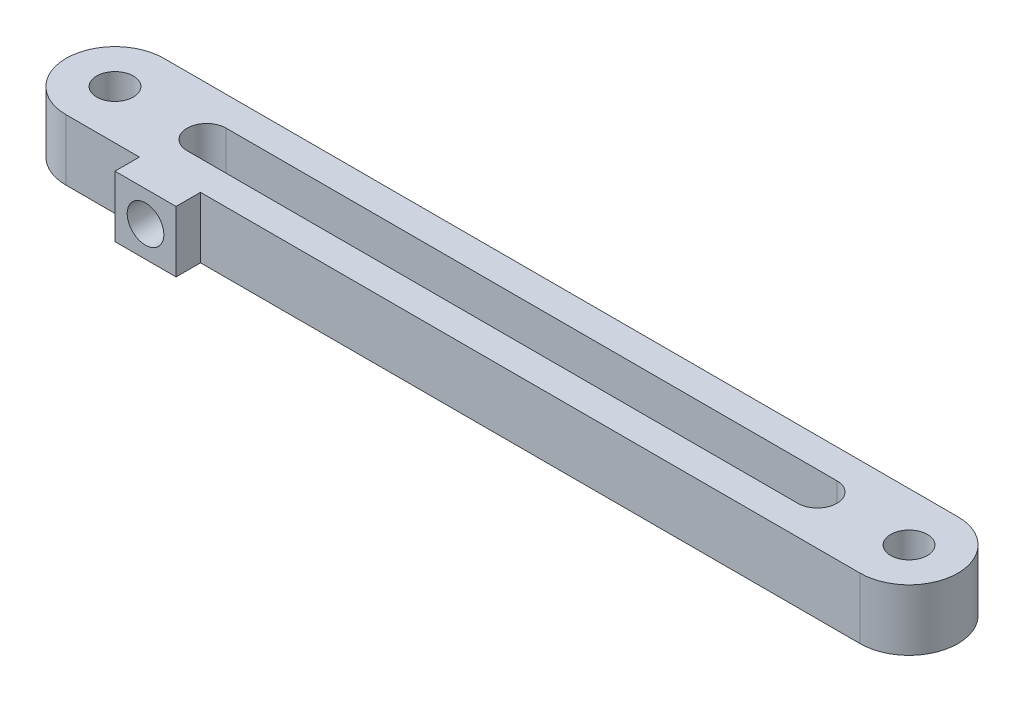
ISO-10303-21;
HEADER;
FILE_DESCRIPTION(('STEP AP214'),'2;1');
FILE_NAME('part.step','',(''),(''),'','','');
FILE_SCHEMA(('AUTOMOTIVE_DESIGN { 1 0 10303 214 1 1 1 1 }'));
ENDSEC;
DATA;
#1=APPLICATION_CONTEXT('core data for automotive mechanical design processes');
#2=APPLICATION_PROTOCOL_DEFINITION('international standard','automotive_design',2000,#1);
#3=PRODUCT_CONTEXT('',#1,'mechanical');
#4=PRODUCT('Part','Part','',(#3));
#5=PRODUCT_RELATED_PRODUCT_CATEGORY('part','',(#4));
#6=PRODUCT_DEFINITION_FORMATION('','',#4);
#7=PRODUCT_DEFINITION_CONTEXT('part definition',#1,'design');
#8=PRODUCT_DEFINITION('design','',#6,#7);
#9=PRODUCT_DEFINITION_SHAPE('','',#8);
#10=(LENGTH_UNIT() NAMED_UNIT(*) SI_UNIT(.MILLI.,.METRE.));
#11=(NAMED_UNIT(*) PLANE_ANGLE_UNIT() SI_UNIT($,.RADIAN.));
#12=(NAMED_UNIT(*) SI_UNIT($,.STERADIAN.) SOLID_ANGLE_UNIT());
#13=UNCERTAINTY_MEASURE_WITH_UNIT(LENGTH_MEASURE(1.E-05),#10,'distance_accuracy_value','');
#14=(GEOMETRIC_REPRESENTATION_CONTEXT(3) GLOBAL_UNCERTAINTY_ASSIGNED_CONTEXT((#13)) GLOBAL_UNIT_ASSIGNED_CONTEXT((#10,
#11,#12)) REPRESENTATION_CONTEXT('',''));
#15=CARTESIAN_POINT('',(0.,0.,0.));
#16=DIRECTION('',(0.,0.,1.));
#17=DIRECTION('',(1.,0.,0.));
#18=AXIS2_PLACEMENT_3D('',#15,#16,#17);
#19=CARTESIAN_POINT('',(-32.5,5.,4.));
#20=DIRECTION('',(0.,0.,-1.));
#21=DIRECTION('',(-1.,0.,0.));
#22=AXIS2_PLACEMENT_3D('',#19,#20,#21);
#23=PLANE('',#22);
#24=DIRECTION('',(0.,-1.,0.));
#25=VECTOR('',#24,1.);
#26=CARTESIAN_POINT('',(-26.5,5.,3.99999999999999));
#27=LINE('',#26,#25);
#28=CARTESIAN_POINT('',(-26.5,5.,3.99999999999999));
#29=VERTEX_POINT('',#28);
#30=CARTESIAN_POINT('',(-26.5,0.,3.99999999999999));
#31=VERTEX_POINT('',#30);
#32=EDGE_CURVE('E214',#29,#31,#27,.T.);
#33=ORIENTED_EDGE('',*,*,#32,.F.);
#34=DIRECTION('',(1.,0.,0.));
#35=VECTOR('',#34,1.);
#36=CARTESIAN_POINT('',(-32.5,5.,4.));
#37=LINE('',#36,#35);
#38=CARTESIAN_POINT('',(-32.5,5.,4.));
#39=VERTEX_POINT('',#38);
#40=EDGE_CURVE('E286',#39,#29,#37,.T.);
#41=ORIENTED_EDGE('',*,*,#40,.F.);
#42=DIRECTION('',(0.,-1.,0.));
#43=VECTOR('',#42,1.);
#44=CARTESIAN_POINT('',(-32.5,5.,4.));
#45=LINE('',#44,#43);
#46=CARTESIAN_POINT('',(-32.5,0.,4.));
#47=VERTEX_POINT('',#46);
#48=EDGE_CURVE('E12',#39,#47,#45,.T.);
#49=ORIENTED_EDGE('',*,*,#48,.T.);
#50=DIRECTION('',(1.,0.,0.));
#51=VECTOR('',#50,1.);
#52=CARTESIAN_POINT('',(-32.5,0.,4.));
#53=LINE('',#52,#51);
#54=EDGE_CURVE('E302',#47,#31,#53,.T.);
#55=ORIENTED_EDGE('',*,*,#54,.T.);
#56=EDGE_LOOP('',(#33,#41,#49,#55));
#57=FACE_BOUND('',#56,.T.);
#58=ADVANCED_FACE('F97',(#57),#23,.F.);
#59=DIRECTION('',(0.,1.,0.));
#60=VECTOR('',#59,1.);
#61=CARTESIAN_POINT('',(-21.5,5.,3.99999999999999));
#62=LINE('',#61,#60);
#63=CARTESIAN_POINT('',(-21.5,0.,3.99999999999999));
#64=VERTEX_POINT('',#63);
#65=CARTESIAN_POINT('',(-21.5,5.,4.));
#66=VERTEX_POINT('',#65);
#67=EDGE_CURVE('E210',#64,#66,#62,.T.);
#68=ORIENTED_EDGE('',*,*,#67,.F.);
#69=CARTESIAN_POINT('',(32.5,0.,3.99999999999999));
#70=VERTEX_POINT('',#69);
#71=EDGE_CURVE('E301',#64,#70,#53,.T.);
#72=ORIENTED_EDGE('',*,*,#71,.T.);
#73=DIRECTION('',(0.,-1.,0.));
#74=VECTOR('',#73,1.);
#75=CARTESIAN_POINT('',(32.5,5.,3.99999999999999));
#76=LINE('',#75,#74);
#77=CARTESIAN_POINT('',(32.5,5.,3.99999999999999));
#78=VERTEX_POINT('',#77);
#79=EDGE_CURVE('E106',#78,#70,#76,.T.);
#80=ORIENTED_EDGE('',*,*,#79,.F.);
#81=EDGE_CURVE('E284',#66,#78,#37,.T.);
#82=ORIENTED_EDGE('',*,*,#81,.F.);
#83=EDGE_LOOP('',(#68,#72,#80,#82));
#84=FACE_BOUND('',#83,.T.);
#85=ADVANCED_FACE('F337',(#84),#23,.F.);
#86=CARTESIAN_POINT('',(-32.5,5.,0.));
#87=DIRECTION('',(0.,1.,0.));
#88=DIRECTION('',(0.,0.,1.));
#89=AXIS2_PLACEMENT_3D('',#86,#87,#88);
#90=PLANE('',#89);
#91=CARTESIAN_POINT('',(32.5,5.,0.));
#92=DIRECTION('',(0.,1.,0.));
#93=DIRECTION('',(0.,0.,1.));
#94=AXIS2_PLACEMENT_3D('',#91,#92,#93);
#95=CIRCLE('',#94,1.5);
#96=CARTESIAN_POINT('',(32.5,5.,1.49999999999998));
#97=VERTEX_POINT('',#96);
#98=EDGE_CURVE('E272',#97,#97,#95,.T.);
#99=ORIENTED_EDGE('',*,*,#98,.F.);
#100=EDGE_LOOP('',(#99));
#101=FACE_BOUND('',#100,.T.);
#102=CARTESIAN_POINT('',(-32.5,5.,0.));
#103=DIRECTION('',(0.,1.,0.));
#104=DIRECTION('',(0.,0.,1.));
#105=AXIS2_PLACEMENT_3D('',#102,#103,#104);
#106=CIRCLE('',#105,4.);
#107=CARTESIAN_POINT('',(-32.5,5.,-4.));
#108=VERTEX_POINT('',#107);
#109=EDGE_CURVE('E280',#108,#39,#106,.T.);
#110=ORIENTED_EDGE('',*,*,#109,.T.);
#111=ORIENTED_EDGE('',*,*,#40,.T.);
#112=DIRECTION('',(0.,0.,-1.));
#113=VECTOR('',#112,1.);
#114=CARTESIAN_POINT('',(-26.5,5.,5.99999999999999));
#115=LINE('',#114,#113);
#116=CARTESIAN_POINT('',(-26.5,5.,5.99999999999999));
#117=VERTEX_POINT('',#116);
#118=EDGE_CURVE('E346',#117,#29,#115,.T.);
#119=ORIENTED_EDGE('',*,*,#118,.F.);
#120=DIRECTION('',(-1.,0.,0.));
#121=VECTOR('',#120,1.);
#122=CARTESIAN_POINT('',(-26.5,5.,5.99999999999999));
#123=LINE('',#122,#121);
#124=CARTESIAN_POINT('',(-21.5,5.,5.99999999999999));
#125=VERTEX_POINT('',#124);
#126=EDGE_CURVE('E206',#125,#117,#123,.T.);
#127=ORIENTED_EDGE('',*,*,#126,.F.);
#128=DIRECTION('',(0.,0.,-1.));
#129=VECTOR('',#128,1.);
#130=CARTESIAN_POINT('',(-21.5,5.,5.99999999999999));
#131=LINE('',#130,#129);
#132=EDGE_CURVE('E113',#125,#66,#131,.T.);
#133=ORIENTED_EDGE('',*,*,#132,.T.);
#134=ORIENTED_EDGE('',*,*,#81,.T.);
#135=CARTESIAN_POINT('',(32.5,5.,0.));
#136=DIRECTION('',(0.,1.,0.));
#137=DIRECTION('',(0.,0.,1.));
#138=AXIS2_PLACEMENT_3D('',#135,#136,#137);
#139=CIRCLE('',#138,4.);
#140=CARTESIAN_POINT('',(32.5,5.,-4.00000000000001));
#141=VERTEX_POINT('',#140);
#142=EDGE_CURVE('E290',#78,#141,#139,.T.);
#143=ORIENTED_EDGE('',*,*,#142,.T.);
#144=DIRECTION('',(1.,0.,0.));
#145=VECTOR('',#144,1.);
#146=CARTESIAN_POINT('',(-32.5,5.,-4.));
#147=LINE('',#146,#145);
#148=EDGE_CURVE('E293',#108,#141,#147,.T.);
#149=ORIENTED_EDGE('',*,*,#148,.F.);
#150=EDGE_LOOP('',(#110,#111,#119,#127,#133,#134,#143,#149));
#151=FACE_BOUND('',#150,.T.);
#152=CARTESIAN_POINT('',(-32.5,5.,0.));
#153=DIRECTION('',(0.,1.,0.));
#154=DIRECTION('',(0.,0.,1.));
#155=AXIS2_PLACEMENT_3D('',#152,#153,#154);
#156=CIRCLE('',#155,1.5);
#157=CARTESIAN_POINT('',(-32.5,5.,1.5));
#158=VERTEX_POINT('',#157);
#159=EDGE_CURVE('E264',#158,#158,#156,.T.);
#160=ORIENTED_EDGE('',*,*,#159,.F.);
#161=EDGE_LOOP('',(#160));
#162=FACE_BOUND('',#161,.T.);
#163=DIRECTION('',(1.,0.,0.));
#164=VECTOR('',#163,1.);
#165=CARTESIAN_POINT('',(-25.,5.,1.6));
#166=LINE('',#165,#164);
#167=CARTESIAN_POINT('',(-25.,5.,1.6));
#168=VERTEX_POINT('',#167);
#169=CARTESIAN_POINT('',(25.,5.,1.59999999999999));
#170=VERTEX_POINT('',#169);
#171=EDGE_CURVE('E230',#168,#170,#166,.T.);
#172=ORIENTED_EDGE('',*,*,#171,.F.);
#173=CARTESIAN_POINT('',(-25.,5.,0.));
#174=DIRECTION('',(0.,1.,0.));
#175=DIRECTION('',(0.,0.,1.));
#176=AXIS2_PLACEMENT_3D('',#173,#174,#175);
#177=CIRCLE('',#176,1.6);
#178=CARTESIAN_POINT('',(-25.,5.,-1.6));
#179=VERTEX_POINT('',#178);
#180=EDGE_CURVE('E227',#179,#168,#177,.T.);
#181=ORIENTED_EDGE('',*,*,#180,.F.);
#182=DIRECTION('',(1.,0.,0.));
#183=VECTOR('',#182,1.);
#184=CARTESIAN_POINT('',(-25.,5.,-1.6));
#185=LINE('',#184,#183);
#186=CARTESIAN_POINT('',(25.,5.,-1.60000000000001));
#187=VERTEX_POINT('',#186);
#188=EDGE_CURVE('E237',#179,#187,#185,.T.);
#189=ORIENTED_EDGE('',*,*,#188,.T.);
#190=CARTESIAN_POINT('',(25.,5.,0.));
#191=DIRECTION('',(0.,1.,0.));
#192=DIRECTION('',(0.,0.,1.));
#193=AXIS2_PLACEMENT_3D('',#190,#191,#192);
#194=CIRCLE('',#193,1.6);
#195=EDGE_CURVE('E234',#170,#187,#194,.T.);
#196=ORIENTED_EDGE('',*,*,#195,.F.);
#197=EDGE_LOOP('',(#172,#181,#189,#196));
#198=FACE_BOUND('',#197,.T.);
#199=ADVANCED_FACE('F331',(#101,#151,#162,#198),#90,.T.);
#200=CARTESIAN_POINT('',(-32.5,0.,0.));
#201=DIRECTION('',(0.,1.,0.));
#202=DIRECTION('',(0.,0.,1.));
#203=AXIS2_PLACEMENT_3D('',#200,#201,#202);
#204=PLANE('',#203);
#205=CARTESIAN_POINT('',(-32.5,0.,0.));
#206=DIRECTION('',(0.,1.,0.));
#207=DIRECTION('',(0.,0.,1.));
#208=AXIS2_PLACEMENT_3D('',#205,#206,#207);
#209=CIRCLE('',#208,1.5);
#210=CARTESIAN_POINT('',(-32.5,0.,1.5));
#211=VERTEX_POINT('',#210);
#212=EDGE_CURVE('E263',#211,#211,#209,.T.);
#213=ORIENTED_EDGE('',*,*,#212,.T.);
#214=EDGE_LOOP('',(#213));
#215=FACE_BOUND('',#214,.T.);
#216=CARTESIAN_POINT('',(32.5,0.,0.));
#217=DIRECTION('',(0.,1.,0.));
#218=DIRECTION('',(0.,0.,1.));
#219=AXIS2_PLACEMENT_3D('',#216,#217,#218);
#220=CIRCLE('',#219,1.5);
#221=CARTESIAN_POINT('',(32.5,0.,1.49999999999998));
#222=VERTEX_POINT('',#221);
#223=EDGE_CURVE('E268',#222,#222,#220,.T.);
#224=ORIENTED_EDGE('',*,*,#223,.T.);
#225=EDGE_LOOP('',(#224));
#226=FACE_BOUND('',#225,.T.);
#227=CARTESIAN_POINT('',(-32.5,0.,0.));
#228=DIRECTION('',(0.,1.,0.));
#229=DIRECTION('',(0.,0.,1.));
#230=AXIS2_PLACEMENT_3D('',#227,#228,#229);
#231=CIRCLE('',#230,4.);
#232=CARTESIAN_POINT('',(-32.5,0.,-4.));
#233=VERTEX_POINT('',#232);
#234=EDGE_CURVE('E276',#233,#47,#231,.T.);
#235=ORIENTED_EDGE('',*,*,#234,.F.);
#236=DIRECTION('',(1.,0.,0.));
#237=VECTOR('',#236,1.);
#238=CARTESIAN_POINT('',(-32.5,0.,-4.));
#239=LINE('',#238,#237);
#240=CARTESIAN_POINT('',(32.5,0.,-4.00000000000001));
#241=VERTEX_POINT('',#240);
#242=EDGE_CURVE('E285',#233,#241,#239,.T.);
#243=ORIENTED_EDGE('',*,*,#242,.T.);
#244=CARTESIAN_POINT('',(32.5,0.,0.));
#245=DIRECTION('',(0.,1.,0.));
#246=DIRECTION('',(0.,0.,1.));
#247=AXIS2_PLACEMENT_3D('',#244,#245,#246);
#248=CIRCLE('',#247,4.);
#249=EDGE_CURVE('E305',#70,#241,#248,.T.);
#250=ORIENTED_EDGE('',*,*,#249,.F.);
#251=ORIENTED_EDGE('',*,*,#71,.F.);
#252=DIRECTION('',(0.,0.,-1.));
#253=VECTOR('',#252,1.);
#254=CARTESIAN_POINT('',(-21.5,0.,5.99999999999999));
#255=LINE('',#254,#253);
#256=CARTESIAN_POINT('',(-21.5,0.,5.99999999999999));
#257=VERTEX_POINT('',#256);
#258=EDGE_CURVE('E197',#257,#64,#255,.T.);
#259=ORIENTED_EDGE('',*,*,#258,.F.);
#260=DIRECTION('',(1.,0.,0.));
#261=VECTOR('',#260,1.);
#262=CARTESIAN_POINT('',(-26.5,0.,5.99999999999999));
#263=LINE('',#262,#261);
#264=CARTESIAN_POINT('',(-26.5,0.,5.99999999999999));
#265=VERTEX_POINT('',#264);
#266=EDGE_CURVE('E188',#265,#257,#263,.T.);
#267=ORIENTED_EDGE('',*,*,#266,.F.);
#268=DIRECTION('',(0.,0.,-1.));
#269=VECTOR('',#268,1.);
#270=CARTESIAN_POINT('',(-26.5,0.,5.99999999999999));
#271=LINE('',#270,#269);
#272=EDGE_CURVE('E194',#265,#31,#271,.T.);
#273=ORIENTED_EDGE('',*,*,#272,.T.);
#274=ORIENTED_EDGE('',*,*,#54,.F.);
#275=EDGE_LOOP('',(#235,#243,#250,#251,#259,#267,#273,#274));
#276=FACE_BOUND('',#275,.T.);
#277=CARTESIAN_POINT('',(-25.,0.,0.));
#278=DIRECTION('',(0.,1.,0.));
#279=DIRECTION('',(0.,0.,1.));
#280=AXIS2_PLACEMENT_3D('',#277,#278,#279);
#281=CIRCLE('',#280,1.6);
#282=CARTESIAN_POINT('',(-25.,0.,-1.6));
#283=VERTEX_POINT('',#282);
#284=CARTESIAN_POINT('',(-25.,0.,1.6));
#285=VERTEX_POINT('',#284);
#286=EDGE_CURVE('E217',#283,#285,#281,.T.);
#287=ORIENTED_EDGE('',*,*,#286,.T.);
#288=DIRECTION('',(1.,0.,0.));
#289=VECTOR('',#288,1.);
#290=CARTESIAN_POINT('',(-25.,0.,1.6));
#291=LINE('',#290,#289);
#292=CARTESIAN_POINT('',(25.,0.,1.59999999999999));
#293=VERTEX_POINT('',#292);
#294=EDGE_CURVE('E222',#285,#293,#291,.T.);
#295=ORIENTED_EDGE('',*,*,#294,.T.);
#296=CARTESIAN_POINT('',(25.,0.,0.));
#297=DIRECTION('',(0.,1.,0.));
#298=DIRECTION('',(0.,0.,1.));
#299=AXIS2_PLACEMENT_3D('',#296,#297,#298);
#300=CIRCLE('',#299,1.6);
#301=CARTESIAN_POINT('',(25.,0.,-1.60000000000001));
#302=VERTEX_POINT('',#301);
#303=EDGE_CURVE('E245',#293,#302,#300,.T.);
#304=ORIENTED_EDGE('',*,*,#303,.T.);
#305=DIRECTION('',(1.,0.,0.));
#306=VECTOR('',#305,1.);
#307=CARTESIAN_POINT('',(-25.,0.,-1.6));
#308=LINE('',#307,#306);
#309=EDGE_CURVE('E231',#283,#302,#308,.T.);
#310=ORIENTED_EDGE('',*,*,#309,.F.);
#311=EDGE_LOOP('',(#287,#295,#304,#310));
#312=FACE_BOUND('',#311,.T.);
#313=ADVANCED_FACE('F191',(#215,#226,#276,#312),#204,.F.);
#314=CARTESIAN_POINT('',(-32.5,5.,0.));
#315=DIRECTION('',(0.,-1.,0.));
#316=DIRECTION('',(0.,0.,-1.));
#317=AXIS2_PLACEMENT_3D('',#314,#315,#316);
#318=CYLINDRICAL_SURFACE('',#317,4.);
#319=ORIENTED_EDGE('',*,*,#234,.T.);
#320=ORIENTED_EDGE('',*,*,#48,.F.);
#321=ORIENTED_EDGE('',*,*,#109,.F.);
#322=DIRECTION('',(0.,-1.,0.));
#323=VECTOR('',#322,1.);
#324=CARTESIAN_POINT('',(-32.5,5.,-4.));
#325=LINE('',#324,#323);
#326=EDGE_CURVE('E297',#108,#233,#325,.T.);
#327=ORIENTED_EDGE('',*,*,#326,.T.);
#328=EDGE_LOOP('',(#319,#320,#321,#327));
#329=FACE_BOUND('',#328,.T.);
#330=ADVANCED_FACE('F99',(#329),#318,.T.);
#331=CARTESIAN_POINT('',(32.5,5.,0.));
#332=DIRECTION('',(0.,-1.,0.));
#333=DIRECTION('',(0.,0.,-1.));
#334=AXIS2_PLACEMENT_3D('',#331,#332,#333);
#335=CYLINDRICAL_SURFACE('',#334,4.);
#336=ORIENTED_EDGE('',*,*,#249,.T.);
#337=DIRECTION('',(0.,-1.,0.));
#338=VECTOR('',#337,1.);
#339=CARTESIAN_POINT('',(32.5,5.,-4.00000000000001));
#340=LINE('',#339,#338);
#341=EDGE_CURVE('E314',#141,#241,#340,.T.);
#342=ORIENTED_EDGE('',*,*,#341,.F.);
#343=ORIENTED_EDGE('',*,*,#142,.F.);
#344=ORIENTED_EDGE('',*,*,#79,.T.);
#345=EDGE_LOOP('',(#336,#342,#343,#344));
#346=FACE_BOUND('',#345,.T.);
#347=ADVANCED_FACE('F322',(#346),#335,.T.);
#348=CARTESIAN_POINT('',(-32.5,5.,-4.));
#349=DIRECTION('',(0.,0.,-1.));
#350=DIRECTION('',(-1.,0.,0.));
#351=AXIS2_PLACEMENT_3D('',#348,#349,#350);
#352=PLANE('',#351);
#353=ORIENTED_EDGE('',*,*,#242,.F.);
#354=ORIENTED_EDGE('',*,*,#326,.F.);
#355=ORIENTED_EDGE('',*,*,#148,.T.);
#356=ORIENTED_EDGE('',*,*,#341,.T.);
#357=EDGE_LOOP('',(#353,#354,#355,#356));
#358=FACE_BOUND('',#357,.T.);
#359=ADVANCED_FACE('F328',(#358),#352,.T.);
#360=CARTESIAN_POINT('',(32.5,5.,0.));
#361=DIRECTION('',(0.,-1.,0.));
#362=DIRECTION('',(0.,0.,-1.));
#363=AXIS2_PLACEMENT_3D('',#360,#361,#362);
#364=CYLINDRICAL_SURFACE('',#363,1.5);
#365=ORIENTED_EDGE('',*,*,#98,.T.);
#366=EDGE_LOOP('',(#365));
#367=FACE_BOUND('',#366,.T.);
#368=ORIENTED_EDGE('',*,*,#223,.F.);
#369=EDGE_LOOP('',(#368));
#370=FACE_BOUND('',#369,.T.);
#371=ADVANCED_FACE('F386',(#367,#370),#364,.F.);
#372=CARTESIAN_POINT('',(-32.5,5.,0.));
#373=DIRECTION('',(0.,-1.,0.));
#374=DIRECTION('',(0.,0.,-1.));
#375=AXIS2_PLACEMENT_3D('',#372,#373,#374);
#376=CYLINDRICAL_SURFACE('',#375,1.5);
#377=ORIENTED_EDGE('',*,*,#159,.T.);
#378=EDGE_LOOP('',(#377));
#379=FACE_BOUND('',#378,.T.);
#380=ORIENTED_EDGE('',*,*,#212,.F.);
#381=EDGE_LOOP('',(#380));
#382=FACE_BOUND('',#381,.T.);
#383=ADVANCED_FACE('F395',(#379,#382),#376,.F.);
#384=CARTESIAN_POINT('',(-25.,5.,0.));
#385=DIRECTION('',(0.,-1.,0.));
#386=DIRECTION('',(0.,0.,-1.));
#387=AXIS2_PLACEMENT_3D('',#384,#385,#386);
#388=CYLINDRICAL_SURFACE('',#387,1.6);
#389=ORIENTED_EDGE('',*,*,#286,.F.);
#390=DIRECTION('',(0.,-1.,0.));
#391=VECTOR('',#390,1.);
#392=CARTESIAN_POINT('',(-25.,5.,-1.6));
#393=LINE('',#392,#391);
#394=EDGE_CURVE('E240',#179,#283,#393,.T.);
#395=ORIENTED_EDGE('',*,*,#394,.F.);
#396=ORIENTED_EDGE('',*,*,#180,.T.);
#397=DIRECTION('',(0.,-1.,0.));
#398=VECTOR('',#397,1.);
#399=CARTESIAN_POINT('',(-25.,5.,1.6));
#400=LINE('',#399,#398);
#401=EDGE_CURVE('E259',#168,#285,#400,.T.);
#402=ORIENTED_EDGE('',*,*,#401,.T.);
#403=EDGE_LOOP('',(#389,#395,#396,#402));
#404=FACE_BOUND('',#403,.T.);
#405=ADVANCED_FACE('F399',(#404),#388,.F.);
#406=CARTESIAN_POINT('',(-25.,5.,1.6));
#407=DIRECTION('',(0.,0.,-1.));
#408=DIRECTION('',(-1.,0.,0.));
#409=AXIS2_PLACEMENT_3D('',#406,#407,#408);
#410=PLANE('',#409);
#411=ORIENTED_EDGE('',*,*,#294,.F.);
#412=ORIENTED_EDGE('',*,*,#401,.F.);
#413=ORIENTED_EDGE('',*,*,#171,.T.);
#414=DIRECTION('',(0.,-1.,0.));
#415=VECTOR('',#414,1.);
#416=CARTESIAN_POINT('',(25.,5.,1.59999999999999));
#417=LINE('',#416,#415);
#418=EDGE_CURVE('E256',#170,#293,#417,.T.);
#419=ORIENTED_EDGE('',*,*,#418,.T.);
#420=EDGE_LOOP('',(#411,#412,#413,#419));
#421=FACE_BOUND('',#420,.T.);
#422=ADVANCED_FACE('F403',(#421),#410,.T.);
#423=CARTESIAN_POINT('',(25.,5.,0.));
#424=DIRECTION('',(0.,-1.,0.));
#425=DIRECTION('',(0.,0.,-1.));
#426=AXIS2_PLACEMENT_3D('',#423,#424,#425);
#427=CYLINDRICAL_SURFACE('',#426,1.6);
#428=ORIENTED_EDGE('',*,*,#303,.F.);
#429=ORIENTED_EDGE('',*,*,#418,.F.);
#430=ORIENTED_EDGE('',*,*,#195,.T.);
#431=DIRECTION('',(0.,-1.,0.));
#432=VECTOR('',#431,1.);
#433=CARTESIAN_POINT('',(25.,5.,-1.60000000000001));
#434=LINE('',#433,#432);
#435=EDGE_CURVE('E121',#187,#302,#434,.T.);
#436=ORIENTED_EDGE('',*,*,#435,.T.);
#437=EDGE_LOOP('',(#428,#429,#430,#436));
#438=FACE_BOUND('',#437,.T.);
#439=ADVANCED_FACE('F407',(#438),#427,.F.);
#440=CARTESIAN_POINT('',(-25.,5.,-1.6));
#441=DIRECTION('',(0.,0.,-1.));
#442=DIRECTION('',(-1.,0.,0.));
#443=AXIS2_PLACEMENT_3D('',#440,#441,#442);
#444=PLANE('',#443);
#445=ORIENTED_EDGE('',*,*,#309,.T.);
#446=ORIENTED_EDGE('',*,*,#435,.F.);
#447=ORIENTED_EDGE('',*,*,#188,.F.);
#448=ORIENTED_EDGE('',*,*,#394,.T.);
#449=EDGE_LOOP('',(#445,#446,#447,#448));
#450=FACE_BOUND('',#449,.T.);
#451=ADVANCED_FACE('F411',(#450),#444,.F.);
#452=CARTESIAN_POINT('',(-26.5,5.,5.99999999999999));
#453=DIRECTION('',(1.,0.,0.));
#454=DIRECTION('',(0.,0.,-1.));
#455=AXIS2_PLACEMENT_3D('',#452,#453,#454);
#456=PLANE('',#455);
#457=ORIENTED_EDGE('',*,*,#32,.T.);
#458=ORIENTED_EDGE('',*,*,#272,.F.);
#459=DIRECTION('',(0.,-1.,0.));
#460=VECTOR('',#459,1.);
#461=CARTESIAN_POINT('',(-26.5,5.,5.99999999999999));
#462=LINE('',#461,#460);
#463=EDGE_CURVE('E202',#117,#265,#462,.T.);
#464=ORIENTED_EDGE('',*,*,#463,.F.);
#465=ORIENTED_EDGE('',*,*,#118,.T.);
#466=EDGE_LOOP('',(#457,#458,#464,#465));
#467=FACE_BOUND('',#466,.T.);
#468=ADVANCED_FACE('F212',(#467),#456,.F.);
#469=CARTESIAN_POINT('',(-21.5,5.,5.99999999999999));
#470=DIRECTION('',(-1.,0.,0.));
#471=DIRECTION('',(0.,0.,1.));
#472=AXIS2_PLACEMENT_3D('',#469,#470,#471);
#473=PLANE('',#472);
#474=ORIENTED_EDGE('',*,*,#67,.T.);
#475=ORIENTED_EDGE('',*,*,#132,.F.);
#476=DIRECTION('',(0.,1.,0.));
#477=VECTOR('',#476,1.);
#478=CARTESIAN_POINT('',(-21.5,5.,5.99999999999999));
#479=LINE('',#478,#477);
#480=EDGE_CURVE('E201',#257,#125,#479,.T.);
#481=ORIENTED_EDGE('',*,*,#480,.F.);
#482=ORIENTED_EDGE('',*,*,#258,.T.);
#483=EDGE_LOOP('',(#474,#475,#481,#482));
#484=FACE_BOUND('',#483,.T.);
#485=ADVANCED_FACE('F370',(#484),#473,.F.);
#486=CARTESIAN_POINT('',(0.,0.,5.99999999999999));
#487=DIRECTION('',(0.,0.,1.));
#488=DIRECTION('',(1.,0.,0.));
#489=AXIS2_PLACEMENT_3D('',#486,#487,#488);
#490=PLANE('',#489);
#491=CARTESIAN_POINT('',(-24.,2.5,5.99999999999999));
#492=DIRECTION('',(0.,0.,1.));
#493=DIRECTION('',(1.,0.,0.));
#494=AXIS2_PLACEMENT_3D('',#491,#492,#493);
#495=CIRCLE('',#494,1.5);
#496=CARTESIAN_POINT('',(-22.5,2.5,5.99999999999999));
#497=VERTEX_POINT('',#496);
#498=EDGE_CURVE('E353',#497,#497,#495,.T.);
#499=ORIENTED_EDGE('',*,*,#498,.F.);
#500=EDGE_LOOP('',(#499));
#501=FACE_BOUND('',#500,.T.);
#502=ORIENTED_EDGE('',*,*,#463,.T.);
#503=ORIENTED_EDGE('',*,*,#266,.T.);
#504=ORIENTED_EDGE('',*,*,#480,.T.);
#505=ORIENTED_EDGE('',*,*,#126,.T.);
#506=EDGE_LOOP('',(#502,#503,#504,#505));
#507=FACE_BOUND('',#506,.T.);
#508=ADVANCED_FACE('F205',(#501,#507),#490,.T.);
#509=CARTESIAN_POINT('',(-24.,2.5,2.99999999999999));
#510=DIRECTION('',(0.,0.,1.));
#511=DIRECTION('',(1.,0.,0.));
#512=AXIS2_PLACEMENT_3D('',#509,#510,#511);
#513=CYLINDRICAL_SURFACE('',#512,1.5);
#514=CARTESIAN_POINT('',(-24.,2.5,2.99999999999999));
#515=DIRECTION('',(0.,0.,1.));
#516=DIRECTION('',(1.,0.,0.));
#517=AXIS2_PLACEMENT_3D('',#514,#515,#516);
#518=CIRCLE('',#517,1.5);
#519=CARTESIAN_POINT('',(-22.5,2.5,2.99999999999999));
#520=VERTEX_POINT('',#519);
#521=EDGE_CURVE('E342',#520,#520,#518,.T.);
#522=ORIENTED_EDGE('',*,*,#521,.F.);
#523=EDGE_LOOP('',(#522));
#524=FACE_BOUND('',#523,.T.);
#525=ORIENTED_EDGE('',*,*,#498,.T.);
#526=EDGE_LOOP('',(#525));
#527=FACE_BOUND('',#526,.T.);
#528=ADVANCED_FACE('F363',(#524,#527),#513,.F.);
#529=CARTESIAN_POINT('',(-24.,2.5,2.99999999999999));
#530=DIRECTION('',(0.,0.,1.));
#531=DIRECTION('',(1.,0.,0.));
#532=AXIS2_PLACEMENT_3D('',#529,#530,#531);
#533=PLANE('',#532);
#534=ORIENTED_EDGE('',*,*,#521,.T.);
#535=EDGE_LOOP('',(#534));
#536=FACE_BOUND('',#535,.T.);
#537=ADVANCED_FACE('F361',(#536),#533,.T.);
#538=CLOSED_SHELL('',(#58,#85,#199,#313,#330,#347,#359,#371,#383,#405,#422,#439,#451,#468,#485,
#508,#528,#537));
#539=MANIFOLD_SOLID_BREP('B2',#538);
#540=ADVANCED_BREP_SHAPE_REPRESENTATION('',(#18,#539),#14);
#541=SHAPE_DEFINITION_REPRESENTATION(#9,#540);
ENDSEC;
END-ISO-10303-21;
